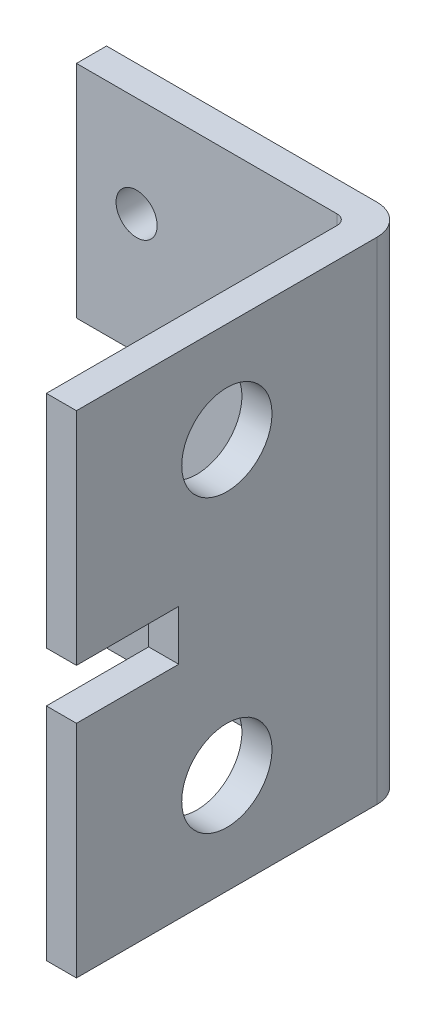
ISO-10303-21;
HEADER;
FILE_DESCRIPTION(('STEP AP214'),'2;1');
FILE_NAME('part.step','',(''),(''),'','','');
FILE_SCHEMA(('AUTOMOTIVE_DESIGN { 1 0 10303 214 1 1 1 1 }'));
ENDSEC;
DATA;
#1=APPLICATION_CONTEXT('core data for automotive mechanical design processes');
#2=APPLICATION_PROTOCOL_DEFINITION('international standard','automotive_design',2000,#1);
#3=PRODUCT_CONTEXT('',#1,'mechanical');
#4=PRODUCT('Part','Part','',(#3));
#5=PRODUCT_RELATED_PRODUCT_CATEGORY('part','',(#4));
#6=PRODUCT_DEFINITION_FORMATION('','',#4);
#7=PRODUCT_DEFINITION_CONTEXT('part definition',#1,'design');
#8=PRODUCT_DEFINITION('design','',#6,#7);
#9=PRODUCT_DEFINITION_SHAPE('','',#8);
#10=(LENGTH_UNIT() NAMED_UNIT(*) SI_UNIT(.MILLI.,.METRE.));
#11=(NAMED_UNIT(*) PLANE_ANGLE_UNIT() SI_UNIT($,.RADIAN.));
#12=(NAMED_UNIT(*) SI_UNIT($,.STERADIAN.) SOLID_ANGLE_UNIT());
#13=UNCERTAINTY_MEASURE_WITH_UNIT(LENGTH_MEASURE(1.E-05),#10,'distance_accuracy_value','');
#14=(GEOMETRIC_REPRESENTATION_CONTEXT(3) GLOBAL_UNCERTAINTY_ASSIGNED_CONTEXT((#13)) GLOBAL_UNIT_ASSIGNED_CONTEXT((#10,
#11,#12)) REPRESENTATION_CONTEXT('',''));
#15=CARTESIAN_POINT('',(0.,0.,0.));
#16=DIRECTION('',(0.,0.,1.));
#17=DIRECTION('',(1.,0.,0.));
#18=AXIS2_PLACEMENT_3D('',#15,#16,#17);
#19=CARTESIAN_POINT('',(30.,-33.1360830515618,33.));
#20=DIRECTION('',(0.,0.,1.));
#21=DIRECTION('',(1.,0.,0.));
#22=AXIS2_PLACEMENT_3D('',#19,#20,#21);
#23=PLANE('',#22);
#24=DIRECTION('',(-1.,0.,0.));
#25=VECTOR('',#24,1.);
#26=CARTESIAN_POINT('',(30.,22.,33.));
#27=LINE('',#26,#25);
#28=CARTESIAN_POINT('',(30.,22.,33.));
#29=VERTEX_POINT('',#28);
#30=CARTESIAN_POINT('',(27.,22.,33.));
#31=VERTEX_POINT('',#30);
#32=EDGE_CURVE('E171',#29,#31,#27,.T.);
#33=ORIENTED_EDGE('',*,*,#32,.T.);
#34=DIRECTION('',(0.,1.,0.));
#35=VECTOR('',#34,1.);
#36=CARTESIAN_POINT('',(27.,-33.1360830515618,33.));
#37=LINE('',#36,#35);
#38=CARTESIAN_POINT('',(27.,0.,33.));
#39=VERTEX_POINT('',#38);
#40=EDGE_CURVE('E237',#39,#31,#37,.T.);
#41=ORIENTED_EDGE('',*,*,#40,.F.);
#42=DIRECTION('',(-1.,0.,0.));
#43=VECTOR('',#42,1.);
#44=CARTESIAN_POINT('',(30.,0.,33.));
#45=LINE('',#44,#43);
#46=CARTESIAN_POINT('',(30.,0.,33.));
#47=VERTEX_POINT('',#46);
#48=EDGE_CURVE('E213',#47,#39,#45,.T.);
#49=ORIENTED_EDGE('',*,*,#48,.F.);
#50=DIRECTION('',(0.,1.,0.));
#51=VECTOR('',#50,1.);
#52=CARTESIAN_POINT('',(30.,-33.1360830515618,33.));
#53=LINE('',#52,#51);
#54=EDGE_CURVE('E234',#47,#29,#53,.T.);
#55=ORIENTED_EDGE('',*,*,#54,.T.);
#56=EDGE_LOOP('',(#33,#41,#49,#55));
#57=FACE_BOUND('',#56,.T.);
#58=ADVANCED_FACE('F33',(#57),#23,.T.);
#59=CARTESIAN_POINT('',(0.,0.,3.));
#60=DIRECTION('',(1.,0.,0.));
#61=DIRECTION('',(0.,0.,-1.));
#62=AXIS2_PLACEMENT_3D('',#59,#60,#61);
#63=PLANE('',#62);
#64=DIRECTION('',(0.,-1.,0.));
#65=VECTOR('',#64,1.);
#66=CARTESIAN_POINT('',(0.,0.,0.));
#67=LINE('',#66,#65);
#68=CARTESIAN_POINT('',(0.,49.,0.));
#69=VERTEX_POINT('',#68);
#70=CARTESIAN_POINT('',(0.,27.,0.));
#71=VERTEX_POINT('',#70);
#72=EDGE_CURVE('E277',#69,#71,#67,.T.);
#73=ORIENTED_EDGE('',*,*,#72,.T.);
#74=DIRECTION('',(0.,0.,1.));
#75=VECTOR('',#74,1.);
#76=CARTESIAN_POINT('',(0.,27.,3.));
#77=LINE('',#76,#75);
#78=CARTESIAN_POINT('',(0.,27.,3.));
#79=VERTEX_POINT('',#78);
#80=EDGE_CURVE('E11',#71,#79,#77,.T.);
#81=ORIENTED_EDGE('',*,*,#80,.T.);
#82=DIRECTION('',(0.,-1.,0.));
#83=VECTOR('',#82,1.);
#84=CARTESIAN_POINT('',(0.,0.,3.));
#85=LINE('',#84,#83);
#86=CARTESIAN_POINT('',(0.,49.,3.));
#87=VERTEX_POINT('',#86);
#88=EDGE_CURVE('E267',#87,#79,#85,.T.);
#89=ORIENTED_EDGE('',*,*,#88,.F.);
#90=DIRECTION('',(0.,0.,-1.));
#91=VECTOR('',#90,1.);
#92=CARTESIAN_POINT('',(0.,49.,3.));
#93=LINE('',#92,#91);
#94=EDGE_CURVE('E276',#87,#69,#93,.T.);
#95=ORIENTED_EDGE('',*,*,#94,.T.);
#96=EDGE_LOOP('',(#73,#81,#89,#95));
#97=FACE_BOUND('',#96,.T.);
#98=ADVANCED_FACE('F345',(#97),#63,.F.);
#99=CARTESIAN_POINT('',(0.,0.,3.));
#100=DIRECTION('',(0.,0.,-1.));
#101=DIRECTION('',(-1.,0.,0.));
#102=AXIS2_PLACEMENT_3D('',#99,#100,#101);
#103=PLANE('',#102);
#104=ORIENTED_EDGE('',*,*,#88,.T.);
#105=DIRECTION('',(-1.,0.,0.));
#106=VECTOR('',#105,1.);
#107=CARTESIAN_POINT('',(-3.,27.,3.));
#108=LINE('',#107,#106);
#109=CARTESIAN_POINT('',(10.2,27.,3.));
#110=VERTEX_POINT('',#109);
#111=EDGE_CURVE('E184',#110,#79,#108,.T.);
#112=ORIENTED_EDGE('',*,*,#111,.F.);
#113=DIRECTION('',(0.,1.,0.));
#114=VECTOR('',#113,1.);
#115=CARTESIAN_POINT('',(10.2,27.,3.));
#116=LINE('',#115,#114);
#117=CARTESIAN_POINT('',(10.2,22.,3.));
#118=VERTEX_POINT('',#117);
#119=EDGE_CURVE('E192',#118,#110,#116,.T.);
#120=ORIENTED_EDGE('',*,*,#119,.F.);
#121=DIRECTION('',(1.,0.,0.));
#122=VECTOR('',#121,1.);
#123=CARTESIAN_POINT('',(-3.,22.,3.));
#124=LINE('',#123,#122);
#125=CARTESIAN_POINT('',(0.,22.,3.));
#126=VERTEX_POINT('',#125);
#127=EDGE_CURVE('E181',#126,#118,#124,.T.);
#128=ORIENTED_EDGE('',*,*,#127,.F.);
#129=CARTESIAN_POINT('',(0.,0.,3.));
#130=VERTEX_POINT('',#129);
#131=EDGE_CURVE('E271',#126,#130,#85,.T.);
#132=ORIENTED_EDGE('',*,*,#131,.T.);
#133=DIRECTION('',(1.,0.,0.));
#134=VECTOR('',#133,1.);
#135=CARTESIAN_POINT('',(0.,0.,3.));
#136=LINE('',#135,#134);
#137=CARTESIAN_POINT('',(26.,0.,3.));
#138=VERTEX_POINT('',#137);
#139=EDGE_CURVE('E270',#130,#138,#136,.T.);
#140=ORIENTED_EDGE('',*,*,#139,.T.);
#141=DIRECTION('',(0.,1.,0.));
#142=VECTOR('',#141,1.);
#143=CARTESIAN_POINT('',(26.,0.,3.));
#144=LINE('',#143,#142);
#145=CARTESIAN_POINT('',(26.,49.,3.));
#146=VERTEX_POINT('',#145);
#147=EDGE_CURVE('E292',#138,#146,#144,.T.);
#148=ORIENTED_EDGE('',*,*,#147,.T.);
#149=DIRECTION('',(-1.,0.,0.));
#150=VECTOR('',#149,1.);
#151=CARTESIAN_POINT('',(0.,49.,3.));
#152=LINE('',#151,#150);
#153=EDGE_CURVE('E274',#146,#87,#152,.T.);
#154=ORIENTED_EDGE('',*,*,#153,.T.);
#155=EDGE_LOOP('',(#104,#112,#120,#128,#132,#140,#148,#154));
#156=FACE_BOUND('',#155,.T.);
#157=CARTESIAN_POINT('',(6.00000000000001,39.,3.));
#158=DIRECTION('',(0.,0.,1.));
#159=DIRECTION('',(1.,0.,0.));
#160=AXIS2_PLACEMENT_3D('',#157,#158,#159);
#161=CIRCLE('',#160,2.05000000000001);
#162=CARTESIAN_POINT('',(8.05000000000001,39.,3.));
#163=VERTEX_POINT('',#162);
#164=EDGE_CURVE('E261',#163,#163,#161,.T.);
#165=ORIENTED_EDGE('',*,*,#164,.F.);
#166=EDGE_LOOP('',(#165));
#167=FACE_BOUND('',#166,.T.);
#168=CARTESIAN_POINT('',(21.,39.,3.));
#169=DIRECTION('',(0.,0.,1.));
#170=DIRECTION('',(1.,0.,0.));
#171=AXIS2_PLACEMENT_3D('',#168,#169,#170);
#172=CIRCLE('',#171,2.05);
#173=CARTESIAN_POINT('',(23.05,39.,3.));
#174=VERTEX_POINT('',#173);
#175=EDGE_CURVE('E255',#174,#174,#172,.T.);
#176=ORIENTED_EDGE('',*,*,#175,.F.);
#177=EDGE_LOOP('',(#176));
#178=FACE_BOUND('',#177,.T.);
#179=CARTESIAN_POINT('',(6.,10.,3.));
#180=DIRECTION('',(0.,0.,1.));
#181=DIRECTION('',(1.,0.,0.));
#182=AXIS2_PLACEMENT_3D('',#179,#180,#181);
#183=CIRCLE('',#182,2.05);
#184=CARTESIAN_POINT('',(8.05,10.,3.));
#185=VERTEX_POINT('',#184);
#186=EDGE_CURVE('E249',#185,#185,#183,.T.);
#187=ORIENTED_EDGE('',*,*,#186,.F.);
#188=EDGE_LOOP('',(#187));
#189=FACE_BOUND('',#188,.T.);
#190=CARTESIAN_POINT('',(21.,10.,3.));
#191=DIRECTION('',(0.,0.,1.));
#192=DIRECTION('',(1.,0.,0.));
#193=AXIS2_PLACEMENT_3D('',#190,#191,#192);
#194=CIRCLE('',#193,2.05);
#195=CARTESIAN_POINT('',(23.05,10.,3.));
#196=VERTEX_POINT('',#195);
#197=EDGE_CURVE('E243',#196,#196,#194,.T.);
#198=ORIENTED_EDGE('',*,*,#197,.F.);
#199=EDGE_LOOP('',(#198));
#200=FACE_BOUND('',#199,.T.);
#201=ADVANCED_FACE('F318',(#156,#167,#178,#189,#200),#103,.F.);
#202=CARTESIAN_POINT('',(0.,0.,0.));
#203=DIRECTION('',(0.,0.,-1.));
#204=DIRECTION('',(-1.,0.,0.));
#205=AXIS2_PLACEMENT_3D('',#202,#203,#204);
#206=PLANE('',#205);
#207=DIRECTION('',(-1.,0.,0.));
#208=VECTOR('',#207,1.);
#209=CARTESIAN_POINT('',(-3.,27.,0.));
#210=LINE('',#209,#208);
#211=CARTESIAN_POINT('',(10.2,27.,0.));
#212=VERTEX_POINT('',#211);
#213=EDGE_CURVE('E187',#212,#71,#210,.T.);
#214=ORIENTED_EDGE('',*,*,#213,.T.);
#215=ORIENTED_EDGE('',*,*,#72,.F.);
#216=DIRECTION('',(-1.,0.,0.));
#217=VECTOR('',#216,1.);
#218=CARTESIAN_POINT('',(0.,49.,0.));
#219=LINE('',#218,#217);
#220=CARTESIAN_POINT('',(27.,49.,0.));
#221=VERTEX_POINT('',#220);
#222=EDGE_CURVE('E285',#221,#69,#219,.T.);
#223=ORIENTED_EDGE('',*,*,#222,.F.);
#224=DIRECTION('',(0.,1.,0.));
#225=VECTOR('',#224,1.);
#226=CARTESIAN_POINT('',(27.,0.,0.));
#227=LINE('',#226,#225);
#228=CARTESIAN_POINT('',(27.,0.,0.));
#229=VERTEX_POINT('',#228);
#230=EDGE_CURVE('E283',#229,#221,#227,.T.);
#231=ORIENTED_EDGE('',*,*,#230,.F.);
#232=DIRECTION('',(1.,0.,0.));
#233=VECTOR('',#232,1.);
#234=CARTESIAN_POINT('',(0.,0.,0.));
#235=LINE('',#234,#233);
#236=CARTESIAN_POINT('',(0.,0.,0.));
#237=VERTEX_POINT('',#236);
#238=EDGE_CURVE('E280',#237,#229,#235,.T.);
#239=ORIENTED_EDGE('',*,*,#238,.F.);
#240=CARTESIAN_POINT('',(0.,22.,0.));
#241=VERTEX_POINT('',#240);
#242=EDGE_CURVE('E264',#241,#237,#67,.T.);
#243=ORIENTED_EDGE('',*,*,#242,.F.);
#244=DIRECTION('',(1.,0.,0.));
#245=VECTOR('',#244,1.);
#246=CARTESIAN_POINT('',(-3.,22.,0.));
#247=LINE('',#246,#245);
#248=CARTESIAN_POINT('',(10.2,22.,0.));
#249=VERTEX_POINT('',#248);
#250=EDGE_CURVE('E56',#241,#249,#247,.T.);
#251=ORIENTED_EDGE('',*,*,#250,.T.);
#252=DIRECTION('',(0.,1.,0.));
#253=VECTOR('',#252,1.);
#254=CARTESIAN_POINT('',(10.2,27.,0.));
#255=LINE('',#254,#253);
#256=EDGE_CURVE('E183',#249,#212,#255,.T.);
#257=ORIENTED_EDGE('',*,*,#256,.T.);
#258=EDGE_LOOP('',(#214,#215,#223,#231,#239,#243,#251,#257));
#259=FACE_BOUND('',#258,.T.);
#260=CARTESIAN_POINT('',(6.,10.,0.));
#261=DIRECTION('',(0.,0.,1.));
#262=DIRECTION('',(1.,0.,0.));
#263=AXIS2_PLACEMENT_3D('',#260,#261,#262);
#264=CIRCLE('',#263,2.05);
#265=CARTESIAN_POINT('',(8.05,10.,0.));
#266=VERTEX_POINT('',#265);
#267=EDGE_CURVE('E246',#266,#266,#264,.T.);
#268=ORIENTED_EDGE('',*,*,#267,.T.);
#269=EDGE_LOOP('',(#268));
#270=FACE_BOUND('',#269,.T.);
#271=CARTESIAN_POINT('',(6.00000000000001,39.,0.));
#272=DIRECTION('',(0.,0.,1.));
#273=DIRECTION('',(1.,0.,0.));
#274=AXIS2_PLACEMENT_3D('',#271,#272,#273);
#275=CIRCLE('',#274,2.05000000000001);
#276=CARTESIAN_POINT('',(8.05000000000001,39.,0.));
#277=VERTEX_POINT('',#276);
#278=EDGE_CURVE('E258',#277,#277,#275,.T.);
#279=ORIENTED_EDGE('',*,*,#278,.T.);
#280=EDGE_LOOP('',(#279));
#281=FACE_BOUND('',#280,.T.);
#282=CARTESIAN_POINT('',(21.,39.,0.));
#283=DIRECTION('',(0.,0.,1.));
#284=DIRECTION('',(1.,0.,0.));
#285=AXIS2_PLACEMENT_3D('',#282,#283,#284);
#286=CIRCLE('',#285,2.05);
#287=CARTESIAN_POINT('',(23.05,39.,0.));
#288=VERTEX_POINT('',#287);
#289=EDGE_CURVE('E252',#288,#288,#286,.T.);
#290=ORIENTED_EDGE('',*,*,#289,.T.);
#291=EDGE_LOOP('',(#290));
#292=FACE_BOUND('',#291,.T.);
#293=CARTESIAN_POINT('',(21.,10.,0.));
#294=DIRECTION('',(0.,0.,1.));
#295=DIRECTION('',(1.,0.,0.));
#296=AXIS2_PLACEMENT_3D('',#293,#294,#295);
#297=CIRCLE('',#296,2.05);
#298=CARTESIAN_POINT('',(23.05,10.,0.));
#299=VERTEX_POINT('',#298);
#300=EDGE_CURVE('E242',#299,#299,#297,.T.);
#301=ORIENTED_EDGE('',*,*,#300,.T.);
#302=EDGE_LOOP('',(#301));
#303=FACE_BOUND('',#302,.T.);
#304=ADVANCED_FACE('F308',(#259,#270,#281,#292,#303),#206,.T.);
#305=ORIENTED_EDGE('',*,*,#131,.F.);
#306=DIRECTION('',(0.,0.,-1.));
#307=VECTOR('',#306,1.);
#308=CARTESIAN_POINT('',(0.,22.,3.));
#309=LINE('',#308,#307);
#310=EDGE_CURVE('E41',#126,#241,#309,.T.);
#311=ORIENTED_EDGE('',*,*,#310,.T.);
#312=ORIENTED_EDGE('',*,*,#242,.T.);
#313=DIRECTION('',(0.,0.,-1.));
#314=VECTOR('',#313,1.);
#315=CARTESIAN_POINT('',(0.,0.,3.));
#316=LINE('',#315,#314);
#317=EDGE_CURVE('E289',#130,#237,#316,.T.);
#318=ORIENTED_EDGE('',*,*,#317,.F.);
#319=EDGE_LOOP('',(#305,#311,#312,#318));
#320=FACE_BOUND('',#319,.T.);
#321=ADVANCED_FACE('F303',(#320),#63,.F.);
#322=CARTESIAN_POINT('',(0.,0.,3.));
#323=DIRECTION('',(0.,1.,0.));
#324=DIRECTION('',(0.,0.,1.));
#325=AXIS2_PLACEMENT_3D('',#322,#323,#324);
#326=PLANE('',#325);
#327=ORIENTED_EDGE('',*,*,#238,.T.);
#328=CARTESIAN_POINT('',(27.,0.,3.));
#329=DIRECTION('',(0.,1.,0.));
#330=DIRECTION('',(0.,0.,1.));
#331=AXIS2_PLACEMENT_3D('',#328,#329,#330);
#332=CIRCLE('',#331,3.);
#333=CARTESIAN_POINT('',(30.,0.,3.));
#334=VERTEX_POINT('',#333);
#335=EDGE_CURVE('E218',#229,#334,#332,.F.);
#336=ORIENTED_EDGE('',*,*,#335,.T.);
#337=DIRECTION('',(0.,0.,1.));
#338=VECTOR('',#337,1.);
#339=CARTESIAN_POINT('',(30.,0.,3.));
#340=LINE('',#339,#338);
#341=EDGE_CURVE('E215',#334,#47,#340,.T.);
#342=ORIENTED_EDGE('',*,*,#341,.T.);
#343=ORIENTED_EDGE('',*,*,#48,.T.);
#344=DIRECTION('',(0.,0.,-1.));
#345=VECTOR('',#344,1.);
#346=CARTESIAN_POINT('',(27.,0.,33.));
#347=LINE('',#346,#345);
#348=CARTESIAN_POINT('',(27.,0.,4.));
#349=VERTEX_POINT('',#348);
#350=EDGE_CURVE('E220',#39,#349,#347,.T.);
#351=ORIENTED_EDGE('',*,*,#350,.T.);
#352=CARTESIAN_POINT('',(26.,0.,4.));
#353=DIRECTION('',(0.,1.,0.));
#354=DIRECTION('',(0.,0.,1.));
#355=AXIS2_PLACEMENT_3D('',#352,#353,#354);
#356=CIRCLE('',#355,1.);
#357=EDGE_CURVE('E299',#349,#138,#356,.T.);
#358=ORIENTED_EDGE('',*,*,#357,.T.);
#359=ORIENTED_EDGE('',*,*,#139,.F.);
#360=ORIENTED_EDGE('',*,*,#317,.T.);
#361=EDGE_LOOP('',(#327,#336,#342,#343,#351,#358,#359,#360));
#362=FACE_BOUND('',#361,.T.);
#363=ADVANCED_FACE('F314',(#362),#326,.F.);
#364=CARTESIAN_POINT('',(0.,49.,3.));
#365=DIRECTION('',(0.,-1.,0.));
#366=DIRECTION('',(0.,0.,-1.));
#367=AXIS2_PLACEMENT_3D('',#364,#365,#366);
#368=PLANE('',#367);
#369=ORIENTED_EDGE('',*,*,#222,.T.);
#370=ORIENTED_EDGE('',*,*,#94,.F.);
#371=ORIENTED_EDGE('',*,*,#153,.F.);
#372=CARTESIAN_POINT('',(26.,49.,4.));
#373=DIRECTION('',(0.,-1.,0.));
#374=DIRECTION('',(0.,0.,-1.));
#375=AXIS2_PLACEMENT_3D('',#372,#373,#374);
#376=CIRCLE('',#375,1.);
#377=CARTESIAN_POINT('',(27.,49.,4.));
#378=VERTEX_POINT('',#377);
#379=EDGE_CURVE('E297',#146,#378,#376,.T.);
#380=ORIENTED_EDGE('',*,*,#379,.T.);
#381=DIRECTION('',(0.,0.,1.));
#382=VECTOR('',#381,1.);
#383=CARTESIAN_POINT('',(27.,49.,33.));
#384=LINE('',#383,#382);
#385=CARTESIAN_POINT('',(27.,49.,33.));
#386=VERTEX_POINT('',#385);
#387=EDGE_CURVE('E223',#378,#386,#384,.T.);
#388=ORIENTED_EDGE('',*,*,#387,.T.);
#389=DIRECTION('',(1.,0.,0.));
#390=VECTOR('',#389,1.);
#391=CARTESIAN_POINT('',(30.,49.,33.));
#392=LINE('',#391,#390);
#393=CARTESIAN_POINT('',(30.,49.,33.));
#394=VERTEX_POINT('',#393);
#395=EDGE_CURVE('E226',#386,#394,#392,.T.);
#396=ORIENTED_EDGE('',*,*,#395,.T.);
#397=DIRECTION('',(0.,0.,-1.));
#398=VECTOR('',#397,1.);
#399=CARTESIAN_POINT('',(30.,49.,3.));
#400=LINE('',#399,#398);
#401=CARTESIAN_POINT('',(30.,49.,3.));
#402=VERTEX_POINT('',#401);
#403=EDGE_CURVE('E229',#394,#402,#400,.T.);
#404=ORIENTED_EDGE('',*,*,#403,.T.);
#405=CARTESIAN_POINT('',(27.,49.,3.));
#406=DIRECTION('',(0.,1.,0.));
#407=DIRECTION('',(0.,0.,-1.));
#408=AXIS2_PLACEMENT_3D('',#405,#406,#407);
#409=CIRCLE('',#408,3.);
#410=EDGE_CURVE('E204',#402,#221,#409,.T.);
#411=ORIENTED_EDGE('',*,*,#410,.T.);
#412=EDGE_LOOP('',(#369,#370,#371,#380,#388,#396,#404,#411));
#413=FACE_BOUND('',#412,.T.);
#414=ADVANCED_FACE('F325',(#413),#368,.F.);
#415=CARTESIAN_POINT('',(6.00000000000001,39.,3.));
#416=DIRECTION('',(0.,0.,-1.));
#417=DIRECTION('',(-1.,0.,0.));
#418=AXIS2_PLACEMENT_3D('',#415,#416,#417);
#419=CYLINDRICAL_SURFACE('',#418,2.05000000000001);
#420=ORIENTED_EDGE('',*,*,#164,.T.);
#421=EDGE_LOOP('',(#420));
#422=FACE_BOUND('',#421,.T.);
#423=ORIENTED_EDGE('',*,*,#278,.F.);
#424=EDGE_LOOP('',(#423));
#425=FACE_BOUND('',#424,.T.);
#426=ADVANCED_FACE('F412',(#422,#425),#419,.F.);
#427=CARTESIAN_POINT('',(21.,39.,3.));
#428=DIRECTION('',(0.,0.,-1.));
#429=DIRECTION('',(-1.,0.,0.));
#430=AXIS2_PLACEMENT_3D('',#427,#428,#429);
#431=CYLINDRICAL_SURFACE('',#430,2.05);
#432=ORIENTED_EDGE('',*,*,#175,.T.);
#433=EDGE_LOOP('',(#432));
#434=FACE_BOUND('',#433,.T.);
#435=ORIENTED_EDGE('',*,*,#289,.F.);
#436=EDGE_LOOP('',(#435));
#437=FACE_BOUND('',#436,.T.);
#438=ADVANCED_FACE('F408',(#434,#437),#431,.F.);
#439=CARTESIAN_POINT('',(6.,10.,3.));
#440=DIRECTION('',(0.,0.,-1.));
#441=DIRECTION('',(-1.,0.,0.));
#442=AXIS2_PLACEMENT_3D('',#439,#440,#441);
#443=CYLINDRICAL_SURFACE('',#442,2.05);
#444=ORIENTED_EDGE('',*,*,#186,.T.);
#445=EDGE_LOOP('',(#444));
#446=FACE_BOUND('',#445,.T.);
#447=ORIENTED_EDGE('',*,*,#267,.F.);
#448=EDGE_LOOP('',(#447));
#449=FACE_BOUND('',#448,.T.);
#450=ADVANCED_FACE('F402',(#446,#449),#443,.F.);
#451=CARTESIAN_POINT('',(21.,10.,3.));
#452=DIRECTION('',(0.,0.,-1.));
#453=DIRECTION('',(-1.,0.,0.));
#454=AXIS2_PLACEMENT_3D('',#451,#452,#453);
#455=CYLINDRICAL_SURFACE('',#454,2.05);
#456=ORIENTED_EDGE('',*,*,#197,.T.);
#457=EDGE_LOOP('',(#456));
#458=FACE_BOUND('',#457,.T.);
#459=ORIENTED_EDGE('',*,*,#300,.F.);
#460=EDGE_LOOP('',(#459));
#461=FACE_BOUND('',#460,.T.);
#462=ADVANCED_FACE('F396',(#458,#461),#455,.F.);
#463=CARTESIAN_POINT('',(27.,-33.1360830515618,33.));
#464=DIRECTION('',(-1.,0.,0.));
#465=DIRECTION('',(0.,0.,1.));
#466=AXIS2_PLACEMENT_3D('',#463,#464,#465);
#467=PLANE('',#466);
#468=DIRECTION('',(0.,0.,1.));
#469=VECTOR('',#468,1.);
#470=CARTESIAN_POINT('',(27.,22.,33.));
#471=LINE('',#470,#469);
#472=CARTESIAN_POINT('',(27.,22.,22.8));
#473=VERTEX_POINT('',#472);
#474=EDGE_CURVE('E177',#473,#31,#471,.T.);
#475=ORIENTED_EDGE('',*,*,#474,.F.);
#476=DIRECTION('',(0.,-1.,0.));
#477=VECTOR('',#476,1.);
#478=CARTESIAN_POINT('',(27.,-33.1360830515618,22.8));
#479=LINE('',#478,#477);
#480=CARTESIAN_POINT('',(27.,27.,22.8));
#481=VERTEX_POINT('',#480);
#482=EDGE_CURVE('E179',#481,#473,#479,.T.);
#483=ORIENTED_EDGE('',*,*,#482,.F.);
#484=DIRECTION('',(0.,0.,-1.));
#485=VECTOR('',#484,1.);
#486=CARTESIAN_POINT('',(27.,27.,33.));
#487=LINE('',#486,#485);
#488=CARTESIAN_POINT('',(27.,27.,33.));
#489=VERTEX_POINT('',#488);
#490=EDGE_CURVE('E148',#489,#481,#487,.T.);
#491=ORIENTED_EDGE('',*,*,#490,.F.);
#492=EDGE_CURVE('E232',#489,#386,#37,.T.);
#493=ORIENTED_EDGE('',*,*,#492,.T.);
#494=ORIENTED_EDGE('',*,*,#387,.F.);
#495=DIRECTION('',(0.,1.,0.));
#496=VECTOR('',#495,1.);
#497=CARTESIAN_POINT('',(27.,-33.1360830515618,4.));
#498=LINE('',#497,#496);
#499=EDGE_CURVE('E295',#378,#349,#498,.F.);
#500=ORIENTED_EDGE('',*,*,#499,.T.);
#501=ORIENTED_EDGE('',*,*,#350,.F.);
#502=ORIENTED_EDGE('',*,*,#40,.T.);
#503=EDGE_LOOP('',(#475,#483,#491,#493,#494,#500,#501,#502));
#504=FACE_BOUND('',#503,.T.);
#505=CARTESIAN_POINT('',(27.,39.,18.));
#506=DIRECTION('',(-1.,0.,0.));
#507=DIRECTION('',(0.,0.,1.));
#508=AXIS2_PLACEMENT_3D('',#505,#506,#507);
#509=CIRCLE('',#508,4.5);
#510=CARTESIAN_POINT('',(27.,39.,22.5));
#511=VERTEX_POINT('',#510);
#512=EDGE_CURVE('E205',#511,#511,#509,.T.);
#513=ORIENTED_EDGE('',*,*,#512,.F.);
#514=EDGE_LOOP('',(#513));
#515=FACE_BOUND('',#514,.T.);
#516=CARTESIAN_POINT('',(27.,9.99999999999999,18.));
#517=DIRECTION('',(-1.,0.,0.));
#518=DIRECTION('',(0.,0.,1.));
#519=AXIS2_PLACEMENT_3D('',#516,#517,#518);
#520=CIRCLE('',#519,4.5);
#521=CARTESIAN_POINT('',(27.,9.99999999999999,22.5));
#522=VERTEX_POINT('',#521);
#523=EDGE_CURVE('E198',#522,#522,#520,.T.);
#524=ORIENTED_EDGE('',*,*,#523,.F.);
#525=EDGE_LOOP('',(#524));
#526=FACE_BOUND('',#525,.T.);
#527=ADVANCED_FACE('F330',(#504,#515,#526),#467,.T.);
#528=CARTESIAN_POINT('',(27.,-33.1360830515618,3.));
#529=DIRECTION('',(0.,1.,0.));
#530=DIRECTION('',(0.,0.,1.));
#531=AXIS2_PLACEMENT_3D('',#528,#529,#530);
#532=CYLINDRICAL_SURFACE('',#531,3.);
#533=ORIENTED_EDGE('',*,*,#335,.F.);
#534=ORIENTED_EDGE('',*,*,#230,.T.);
#535=ORIENTED_EDGE('',*,*,#410,.F.);
#536=DIRECTION('',(0.,1.,0.));
#537=VECTOR('',#536,1.);
#538=CARTESIAN_POINT('',(30.,-33.1360830515618,3.));
#539=LINE('',#538,#537);
#540=EDGE_CURVE('E216',#334,#402,#539,.T.);
#541=ORIENTED_EDGE('',*,*,#540,.F.);
#542=EDGE_LOOP('',(#533,#534,#535,#541));
#543=FACE_BOUND('',#542,.T.);
#544=ADVANCED_FACE('F341',(#543),#532,.T.);
#545=CARTESIAN_POINT('',(30.,-33.1360830515618,3.));
#546=DIRECTION('',(1.,0.,0.));
#547=DIRECTION('',(0.,0.,-1.));
#548=AXIS2_PLACEMENT_3D('',#545,#546,#547);
#549=PLANE('',#548);
#550=DIRECTION('',(0.,0.,1.));
#551=VECTOR('',#550,1.);
#552=CARTESIAN_POINT('',(30.,22.,33.));
#553=LINE('',#552,#551);
#554=CARTESIAN_POINT('',(30.,22.,22.8));
#555=VERTEX_POINT('',#554);
#556=EDGE_CURVE('E161',#555,#29,#553,.T.);
#557=ORIENTED_EDGE('',*,*,#556,.T.);
#558=ORIENTED_EDGE('',*,*,#54,.F.);
#559=ORIENTED_EDGE('',*,*,#341,.F.);
#560=ORIENTED_EDGE('',*,*,#540,.T.);
#561=ORIENTED_EDGE('',*,*,#403,.F.);
#562=CARTESIAN_POINT('',(30.,27.,33.));
#563=VERTEX_POINT('',#562);
#564=EDGE_CURVE('E167',#563,#394,#53,.T.);
#565=ORIENTED_EDGE('',*,*,#564,.F.);
#566=DIRECTION('',(0.,0.,-1.));
#567=VECTOR('',#566,1.);
#568=CARTESIAN_POINT('',(30.,27.,33.));
#569=LINE('',#568,#567);
#570=CARTESIAN_POINT('',(30.,27.,22.8));
#571=VERTEX_POINT('',#570);
#572=EDGE_CURVE('E48',#563,#571,#569,.T.);
#573=ORIENTED_EDGE('',*,*,#572,.T.);
#574=DIRECTION('',(0.,-1.,0.));
#575=VECTOR('',#574,1.);
#576=CARTESIAN_POINT('',(30.,27.,22.8));
#577=LINE('',#576,#575);
#578=EDGE_CURVE('E155',#571,#555,#577,.T.);
#579=ORIENTED_EDGE('',*,*,#578,.T.);
#580=EDGE_LOOP('',(#557,#558,#559,#560,#561,#565,#573,#579));
#581=FACE_BOUND('',#580,.T.);
#582=CARTESIAN_POINT('',(30.,39.,18.));
#583=DIRECTION('',(-1.,0.,0.));
#584=DIRECTION('',(0.,0.,1.));
#585=AXIS2_PLACEMENT_3D('',#582,#583,#584);
#586=CIRCLE('',#585,4.5);
#587=CARTESIAN_POINT('',(30.,39.,22.5));
#588=VERTEX_POINT('',#587);
#589=EDGE_CURVE('E201',#588,#588,#586,.T.);
#590=ORIENTED_EDGE('',*,*,#589,.T.);
#591=EDGE_LOOP('',(#590));
#592=FACE_BOUND('',#591,.T.);
#593=CARTESIAN_POINT('',(30.,9.99999999999999,18.));
#594=DIRECTION('',(-1.,0.,0.));
#595=DIRECTION('',(0.,0.,1.));
#596=AXIS2_PLACEMENT_3D('',#593,#594,#595);
#597=CIRCLE('',#596,4.5);
#598=CARTESIAN_POINT('',(30.,9.99999999999999,22.5));
#599=VERTEX_POINT('',#598);
#600=EDGE_CURVE('E208',#599,#599,#597,.T.);
#601=ORIENTED_EDGE('',*,*,#600,.T.);
#602=EDGE_LOOP('',(#601));
#603=FACE_BOUND('',#602,.T.);
#604=ADVANCED_FACE('F164',(#581,#592,#603),#549,.T.);
#605=DIRECTION('',(-1.,0.,0.));
#606=VECTOR('',#605,1.);
#607=CARTESIAN_POINT('',(30.,27.,33.));
#608=LINE('',#607,#606);
#609=EDGE_CURVE('E152',#563,#489,#608,.T.);
#610=ORIENTED_EDGE('',*,*,#609,.F.);
#611=ORIENTED_EDGE('',*,*,#564,.T.);
#612=ORIENTED_EDGE('',*,*,#395,.F.);
#613=ORIENTED_EDGE('',*,*,#492,.F.);
#614=EDGE_LOOP('',(#610,#611,#612,#613));
#615=FACE_BOUND('',#614,.T.);
#616=ADVANCED_FACE('F335',(#615),#23,.T.);
#617=CARTESIAN_POINT('',(30.,9.99999999999999,18.));
#618=DIRECTION('',(-1.,0.,0.));
#619=DIRECTION('',(0.,0.,1.));
#620=AXIS2_PLACEMENT_3D('',#617,#618,#619);
#621=CYLINDRICAL_SURFACE('',#620,4.5);
#622=ORIENTED_EDGE('',*,*,#600,.F.);
#623=EDGE_LOOP('',(#622));
#624=FACE_BOUND('',#623,.T.);
#625=ORIENTED_EDGE('',*,*,#523,.T.);
#626=EDGE_LOOP('',(#625));
#627=FACE_BOUND('',#626,.T.);
#628=ADVANCED_FACE('F374',(#624,#627),#621,.F.);
#629=CARTESIAN_POINT('',(30.,39.,18.));
#630=DIRECTION('',(-1.,0.,0.));
#631=DIRECTION('',(0.,0.,1.));
#632=AXIS2_PLACEMENT_3D('',#629,#630,#631);
#633=CYLINDRICAL_SURFACE('',#632,4.5);
#634=ORIENTED_EDGE('',*,*,#589,.F.);
#635=EDGE_LOOP('',(#634));
#636=FACE_BOUND('',#635,.T.);
#637=ORIENTED_EDGE('',*,*,#512,.T.);
#638=EDGE_LOOP('',(#637));
#639=FACE_BOUND('',#638,.T.);
#640=ADVANCED_FACE('F379',(#636,#639),#633,.F.);
#641=CARTESIAN_POINT('',(26.,0.,4.));
#642=DIRECTION('',(0.,1.,0.));
#643=DIRECTION('',(0.,0.,1.));
#644=AXIS2_PLACEMENT_3D('',#641,#642,#643);
#645=CYLINDRICAL_SURFACE('',#644,1.);
#646=ORIENTED_EDGE('',*,*,#357,.F.);
#647=ORIENTED_EDGE('',*,*,#499,.F.);
#648=ORIENTED_EDGE('',*,*,#379,.F.);
#649=ORIENTED_EDGE('',*,*,#147,.F.);
#650=EDGE_LOOP('',(#646,#647,#648,#649));
#651=FACE_BOUND('',#650,.T.);
#652=ADVANCED_FACE('F35',(#651),#645,.F.);
#653=CARTESIAN_POINT('',(-3.,27.,0.));
#654=DIRECTION('',(0.,1.,0.));
#655=DIRECTION('',(0.,0.,1.));
#656=AXIS2_PLACEMENT_3D('',#653,#654,#655);
#657=PLANE('',#656);
#658=ORIENTED_EDGE('',*,*,#213,.F.);
#659=DIRECTION('',(0.,0.,1.));
#660=VECTOR('',#659,1.);
#661=CARTESIAN_POINT('',(10.2,27.,0.));
#662=LINE('',#661,#660);
#663=EDGE_CURVE('E196',#212,#110,#662,.T.);
#664=ORIENTED_EDGE('',*,*,#663,.T.);
#665=ORIENTED_EDGE('',*,*,#111,.T.);
#666=ORIENTED_EDGE('',*,*,#80,.F.);
#667=EDGE_LOOP('',(#658,#664,#665,#666));
#668=FACE_BOUND('',#667,.T.);
#669=ADVANCED_FACE('F350',(#668),#657,.F.);
#670=CARTESIAN_POINT('',(-3.,22.,0.));
#671=DIRECTION('',(0.,-1.,0.));
#672=DIRECTION('',(0.,0.,-1.));
#673=AXIS2_PLACEMENT_3D('',#670,#671,#672);
#674=PLANE('',#673);
#675=ORIENTED_EDGE('',*,*,#127,.T.);
#676=DIRECTION('',(0.,0.,1.));
#677=VECTOR('',#676,1.);
#678=CARTESIAN_POINT('',(10.2,22.,0.));
#679=LINE('',#678,#677);
#680=EDGE_CURVE('E190',#249,#118,#679,.T.);
#681=ORIENTED_EDGE('',*,*,#680,.F.);
#682=ORIENTED_EDGE('',*,*,#250,.F.);
#683=ORIENTED_EDGE('',*,*,#310,.F.);
#684=EDGE_LOOP('',(#675,#681,#682,#683));
#685=FACE_BOUND('',#684,.T.);
#686=ADVANCED_FACE('F354',(#685),#674,.F.);
#687=CARTESIAN_POINT('',(10.2,27.,0.));
#688=DIRECTION('',(1.,0.,0.));
#689=DIRECTION('',(0.,0.,-1.));
#690=AXIS2_PLACEMENT_3D('',#687,#688,#689);
#691=PLANE('',#690);
#692=ORIENTED_EDGE('',*,*,#119,.T.);
#693=ORIENTED_EDGE('',*,*,#663,.F.);
#694=ORIENTED_EDGE('',*,*,#256,.F.);
#695=ORIENTED_EDGE('',*,*,#680,.T.);
#696=EDGE_LOOP('',(#692,#693,#694,#695));
#697=FACE_BOUND('',#696,.T.);
#698=ADVANCED_FACE('F353',(#697),#691,.F.);
#699=CARTESIAN_POINT('',(30.,22.,33.));
#700=DIRECTION('',(0.,-1.,0.));
#701=DIRECTION('',(0.,0.,-1.));
#702=AXIS2_PLACEMENT_3D('',#699,#700,#701);
#703=PLANE('',#702);
#704=ORIENTED_EDGE('',*,*,#474,.T.);
#705=ORIENTED_EDGE('',*,*,#32,.F.);
#706=ORIENTED_EDGE('',*,*,#556,.F.);
#707=DIRECTION('',(-1.,0.,0.));
#708=VECTOR('',#707,1.);
#709=CARTESIAN_POINT('',(30.,22.,22.8));
#710=LINE('',#709,#708);
#711=EDGE_CURVE('E151',#555,#473,#710,.T.);
#712=ORIENTED_EDGE('',*,*,#711,.T.);
#713=EDGE_LOOP('',(#704,#705,#706,#712));
#714=FACE_BOUND('',#713,.T.);
#715=ADVANCED_FACE('F361',(#714),#703,.F.);
#716=CARTESIAN_POINT('',(30.,27.,22.8));
#717=DIRECTION('',(0.,0.,-1.));
#718=DIRECTION('',(-1.,0.,0.));
#719=AXIS2_PLACEMENT_3D('',#716,#717,#718);
#720=PLANE('',#719);
#721=ORIENTED_EDGE('',*,*,#482,.T.);
#722=ORIENTED_EDGE('',*,*,#711,.F.);
#723=ORIENTED_EDGE('',*,*,#578,.F.);
#724=DIRECTION('',(-1.,0.,0.));
#725=VECTOR('',#724,1.);
#726=CARTESIAN_POINT('',(30.,27.,22.8));
#727=LINE('',#726,#725);
#728=EDGE_CURVE('E144',#571,#481,#727,.T.);
#729=ORIENTED_EDGE('',*,*,#728,.T.);
#730=EDGE_LOOP('',(#721,#722,#723,#729));
#731=FACE_BOUND('',#730,.T.);
#732=ADVANCED_FACE('F156',(#731),#720,.F.);
#733=CARTESIAN_POINT('',(30.,27.,33.));
#734=DIRECTION('',(0.,1.,0.));
#735=DIRECTION('',(0.,0.,1.));
#736=AXIS2_PLACEMENT_3D('',#733,#734,#735);
#737=PLANE('',#736);
#738=ORIENTED_EDGE('',*,*,#490,.T.);
#739=ORIENTED_EDGE('',*,*,#728,.F.);
#740=ORIENTED_EDGE('',*,*,#572,.F.);
#741=ORIENTED_EDGE('',*,*,#609,.T.);
#742=EDGE_LOOP('',(#738,#739,#740,#741));
#743=FACE_BOUND('',#742,.T.);
#744=ADVANCED_FACE('F146',(#743),#737,.F.);
#745=CLOSED_SHELL('',(#58,#98,#201,#304,#321,#363,#414,#426,#438,#450,#462,#527,#544,#604,#616,
#628,#640,#652,#669,#686,#698,#715,#732,#744));
#746=MANIFOLD_SOLID_BREP('B2',#745);
#747=ADVANCED_BREP_SHAPE_REPRESENTATION('',(#18,#746),#14);
#748=SHAPE_DEFINITION_REPRESENTATION(#9,#747);
ENDSEC;
END-ISO-10303-21;
